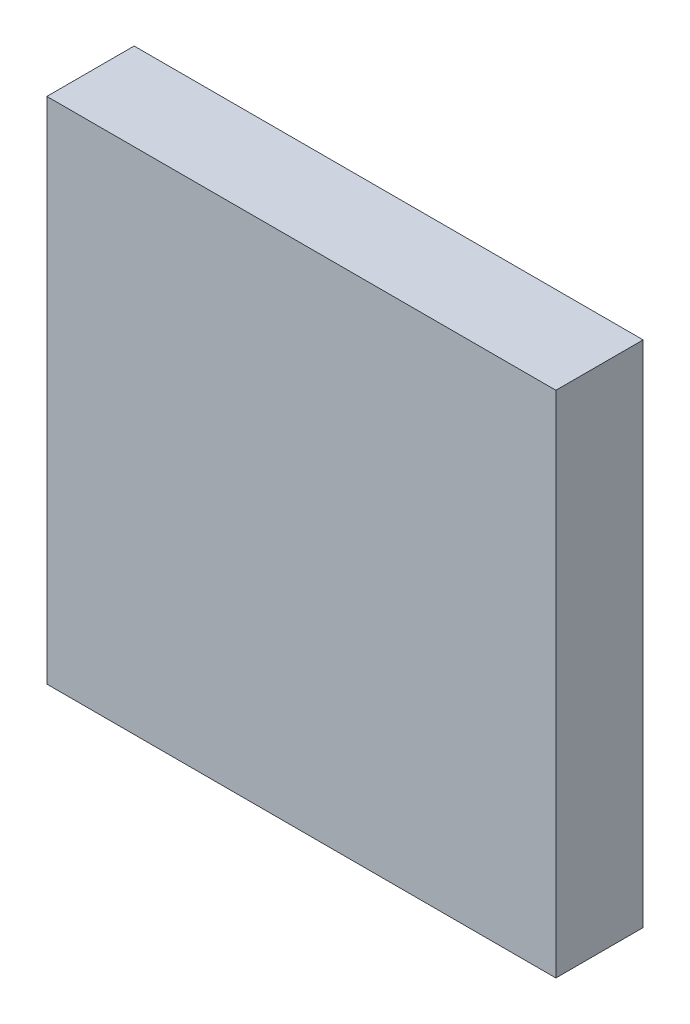
ISO-10303-21;
HEADER;
FILE_DESCRIPTION(('STEP AP214'),'2;1');
FILE_NAME('part.step','',(''),(''),'','','');
FILE_SCHEMA(('AUTOMOTIVE_DESIGN { 1 0 10303 214 1 1 1 1 }'));
ENDSEC;
DATA;
#1=APPLICATION_CONTEXT('core data for automotive mechanical design processes');
#2=APPLICATION_PROTOCOL_DEFINITION('international standard','automotive_design',2000,#1);
#3=PRODUCT_CONTEXT('',#1,'mechanical');
#4=PRODUCT('Part','Part','',(#3));
#5=PRODUCT_RELATED_PRODUCT_CATEGORY('part','',(#4));
#6=PRODUCT_DEFINITION_FORMATION('','',#4);
#7=PRODUCT_DEFINITION_CONTEXT('part definition',#1,'design');
#8=PRODUCT_DEFINITION('design','',#6,#7);
#9=PRODUCT_DEFINITION_SHAPE('','',#8);
#10=(LENGTH_UNIT() NAMED_UNIT(*) SI_UNIT(.MILLI.,.METRE.));
#11=(NAMED_UNIT(*) PLANE_ANGLE_UNIT() SI_UNIT($,.RADIAN.));
#12=(NAMED_UNIT(*) SI_UNIT($,.STERADIAN.) SOLID_ANGLE_UNIT());
#13=UNCERTAINTY_MEASURE_WITH_UNIT(LENGTH_MEASURE(1.E-05),#10,'distance_accuracy_value','');
#14=(GEOMETRIC_REPRESENTATION_CONTEXT(3) GLOBAL_UNCERTAINTY_ASSIGNED_CONTEXT((#13)) GLOBAL_UNIT_ASSIGNED_CONTEXT((#10,
#11,#12)) REPRESENTATION_CONTEXT('',''));
#15=CARTESIAN_POINT('',(0.,0.,0.));
#16=DIRECTION('',(0.,0.,1.));
#17=DIRECTION('',(1.,0.,0.));
#18=AXIS2_PLACEMENT_3D('',#15,#16,#17);
#19=CARTESIAN_POINT('',(-3.50000062,3.50000062,0.));
#20=DIRECTION('',(1.,0.,0.));
#21=DIRECTION('',(0.,-1.,0.));
#22=AXIS2_PLACEMENT_3D('',#19,#20,#21);
#23=PLANE('',#22);
#24=DIRECTION('',(0.,-1.,0.));
#25=VECTOR('',#24,1.);
#26=CARTESIAN_POINT('',(-3.50000062,3.50000062,0.));
#27=LINE('',#26,#25);
#28=CARTESIAN_POINT('',(-3.50000062,3.50000062,0.));
#29=VERTEX_POINT('',#28);
#30=CARTESIAN_POINT('',(-3.50000062,-3.50000062,0.));
#31=VERTEX_POINT('',#30);
#32=EDGE_CURVE('E11',#29,#31,#27,.T.);
#33=ORIENTED_EDGE('',*,*,#32,.T.);
#34=DIRECTION('',(0.,0.,1.));
#35=VECTOR('',#34,1.);
#36=CARTESIAN_POINT('',(-3.50000062,-3.50000062,0.));
#37=LINE('',#36,#35);
#38=CARTESIAN_POINT('',(-3.50000062,-3.50000062,1.20000014));
#39=VERTEX_POINT('',#38);
#40=EDGE_CURVE('E23',#31,#39,#37,.T.);
#41=ORIENTED_EDGE('',*,*,#40,.T.);
#42=DIRECTION('',(0.,-1.,0.));
#43=VECTOR('',#42,1.);
#44=CARTESIAN_POINT('',(-3.50000062,3.50000062,1.20000014));
#45=LINE('',#44,#43);
#46=CARTESIAN_POINT('',(-3.50000062,3.50000062,1.20000014));
#47=VERTEX_POINT('',#46);
#48=EDGE_CURVE('E86',#47,#39,#45,.T.);
#49=ORIENTED_EDGE('',*,*,#48,.F.);
#50=DIRECTION('',(0.,0.,1.));
#51=VECTOR('',#50,1.);
#52=CARTESIAN_POINT('',(-3.50000062,3.50000062,0.));
#53=LINE('',#52,#51);
#54=EDGE_CURVE('E35',#29,#47,#53,.T.);
#55=ORIENTED_EDGE('',*,*,#54,.F.);
#56=EDGE_LOOP('',(#33,#41,#49,#55));
#57=FACE_BOUND('',#56,.T.);
#58=ADVANCED_FACE('F16',(#57),#23,.F.);
#59=CARTESIAN_POINT('',(-3.50000062,-3.50000062,0.));
#60=DIRECTION('',(0.,1.,0.));
#61=DIRECTION('',(1.,0.,0.));
#62=AXIS2_PLACEMENT_3D('',#59,#60,#61);
#63=PLANE('',#62);
#64=DIRECTION('',(1.,0.,0.));
#65=VECTOR('',#64,1.);
#66=CARTESIAN_POINT('',(-3.50000062,-3.50000062,0.));
#67=LINE('',#66,#65);
#68=CARTESIAN_POINT('',(3.50000062,-3.50000062,0.));
#69=VERTEX_POINT('',#68);
#70=EDGE_CURVE('E83',#31,#69,#67,.T.);
#71=ORIENTED_EDGE('',*,*,#70,.T.);
#72=DIRECTION('',(0.,0.,1.));
#73=VECTOR('',#72,1.);
#74=CARTESIAN_POINT('',(3.50000062,-3.50000062,0.));
#75=LINE('',#74,#73);
#76=CARTESIAN_POINT('',(3.50000062,-3.50000062,1.20000014));
#77=VERTEX_POINT('',#76);
#78=EDGE_CURVE('E81',#69,#77,#75,.T.);
#79=ORIENTED_EDGE('',*,*,#78,.T.);
#80=DIRECTION('',(1.,0.,0.));
#81=VECTOR('',#80,1.);
#82=CARTESIAN_POINT('',(-3.50000062,-3.50000062,1.20000014));
#83=LINE('',#82,#81);
#84=EDGE_CURVE('E61',#39,#77,#83,.T.);
#85=ORIENTED_EDGE('',*,*,#84,.F.);
#86=ORIENTED_EDGE('',*,*,#40,.F.);
#87=EDGE_LOOP('',(#71,#79,#85,#86));
#88=FACE_BOUND('',#87,.T.);
#89=ADVANCED_FACE('F88',(#88),#63,.F.);
#90=CARTESIAN_POINT('',(3.50000062,-3.50000062,0.));
#91=DIRECTION('',(-1.,0.,0.));
#92=DIRECTION('',(0.,1.,0.));
#93=AXIS2_PLACEMENT_3D('',#90,#91,#92);
#94=PLANE('',#93);
#95=DIRECTION('',(0.,1.,0.));
#96=VECTOR('',#95,1.);
#97=CARTESIAN_POINT('',(3.50000062,-3.50000062,0.));
#98=LINE('',#97,#96);
#99=CARTESIAN_POINT('',(3.50000062,3.50000062,0.));
#100=VERTEX_POINT('',#99);
#101=EDGE_CURVE('E70',#69,#100,#98,.T.);
#102=ORIENTED_EDGE('',*,*,#101,.T.);
#103=DIRECTION('',(0.,0.,1.));
#104=VECTOR('',#103,1.);
#105=CARTESIAN_POINT('',(3.50000062,3.50000062,0.));
#106=LINE('',#105,#104);
#107=CARTESIAN_POINT('',(3.50000062,3.50000062,1.20000014));
#108=VERTEX_POINT('',#107);
#109=EDGE_CURVE('E64',#100,#108,#106,.T.);
#110=ORIENTED_EDGE('',*,*,#109,.T.);
#111=DIRECTION('',(0.,1.,0.));
#112=VECTOR('',#111,1.);
#113=CARTESIAN_POINT('',(3.50000062,-3.50000062,1.20000014));
#114=LINE('',#113,#112);
#115=EDGE_CURVE('E56',#77,#108,#114,.T.);
#116=ORIENTED_EDGE('',*,*,#115,.F.);
#117=ORIENTED_EDGE('',*,*,#78,.F.);
#118=EDGE_LOOP('',(#102,#110,#116,#117));
#119=FACE_BOUND('',#118,.T.);
#120=ADVANCED_FACE('F68',(#119),#94,.F.);
#121=CARTESIAN_POINT('',(3.50000062,3.50000062,0.));
#122=DIRECTION('',(0.,-1.,0.));
#123=DIRECTION('',(-1.,0.,0.));
#124=AXIS2_PLACEMENT_3D('',#121,#122,#123);
#125=PLANE('',#124);
#126=DIRECTION('',(-1.,0.,0.));
#127=VECTOR('',#126,1.);
#128=CARTESIAN_POINT('',(3.50000062,3.50000062,0.));
#129=LINE('',#128,#127);
#130=EDGE_CURVE('E65',#100,#29,#129,.T.);
#131=ORIENTED_EDGE('',*,*,#130,.T.);
#132=ORIENTED_EDGE('',*,*,#54,.T.);
#133=DIRECTION('',(-1.,0.,0.));
#134=VECTOR('',#133,1.);
#135=CARTESIAN_POINT('',(3.50000062,3.50000062,1.20000014));
#136=LINE('',#135,#134);
#137=EDGE_CURVE('E60',#108,#47,#136,.T.);
#138=ORIENTED_EDGE('',*,*,#137,.F.);
#139=ORIENTED_EDGE('',*,*,#109,.F.);
#140=EDGE_LOOP('',(#131,#132,#138,#139));
#141=FACE_BOUND('',#140,.T.);
#142=ADVANCED_FACE('F75',(#141),#125,.F.);
#143=CARTESIAN_POINT('',(-3.50000062,3.50000062,0.));
#144=DIRECTION('',(0.,0.,-1.));
#145=DIRECTION('',(-1.,0.,0.));
#146=AXIS2_PLACEMENT_3D('',#143,#144,#145);
#147=PLANE('',#146);
#148=ORIENTED_EDGE('',*,*,#130,.F.);
#149=ORIENTED_EDGE('',*,*,#101,.F.);
#150=ORIENTED_EDGE('',*,*,#70,.F.);
#151=ORIENTED_EDGE('',*,*,#32,.F.);
#152=EDGE_LOOP('',(#148,#149,#150,#151));
#153=FACE_BOUND('',#152,.T.);
#154=ADVANCED_FACE('F90',(#153),#147,.T.);
#155=CARTESIAN_POINT('',(-3.50000062,3.50000062,1.20000014));
#156=DIRECTION('',(0.,0.,-1.));
#157=DIRECTION('',(-1.,0.,0.));
#158=AXIS2_PLACEMENT_3D('',#155,#156,#157);
#159=PLANE('',#158);
#160=ORIENTED_EDGE('',*,*,#48,.T.);
#161=ORIENTED_EDGE('',*,*,#84,.T.);
#162=ORIENTED_EDGE('',*,*,#115,.T.);
#163=ORIENTED_EDGE('',*,*,#137,.T.);
#164=EDGE_LOOP('',(#160,#161,#162,#163));
#165=FACE_BOUND('',#164,.T.);
#166=ADVANCED_FACE('F58',(#165),#159,.F.);
#167=CLOSED_SHELL('',(#58,#89,#120,#142,#154,#166));
#168=MANIFOLD_SOLID_BREP('B1',#167);
#169=ADVANCED_BREP_SHAPE_REPRESENTATION('',(#18,#168),#14);
#170=SHAPE_DEFINITION_REPRESENTATION(#9,#169);
ENDSEC;
END-ISO-10303-21;
